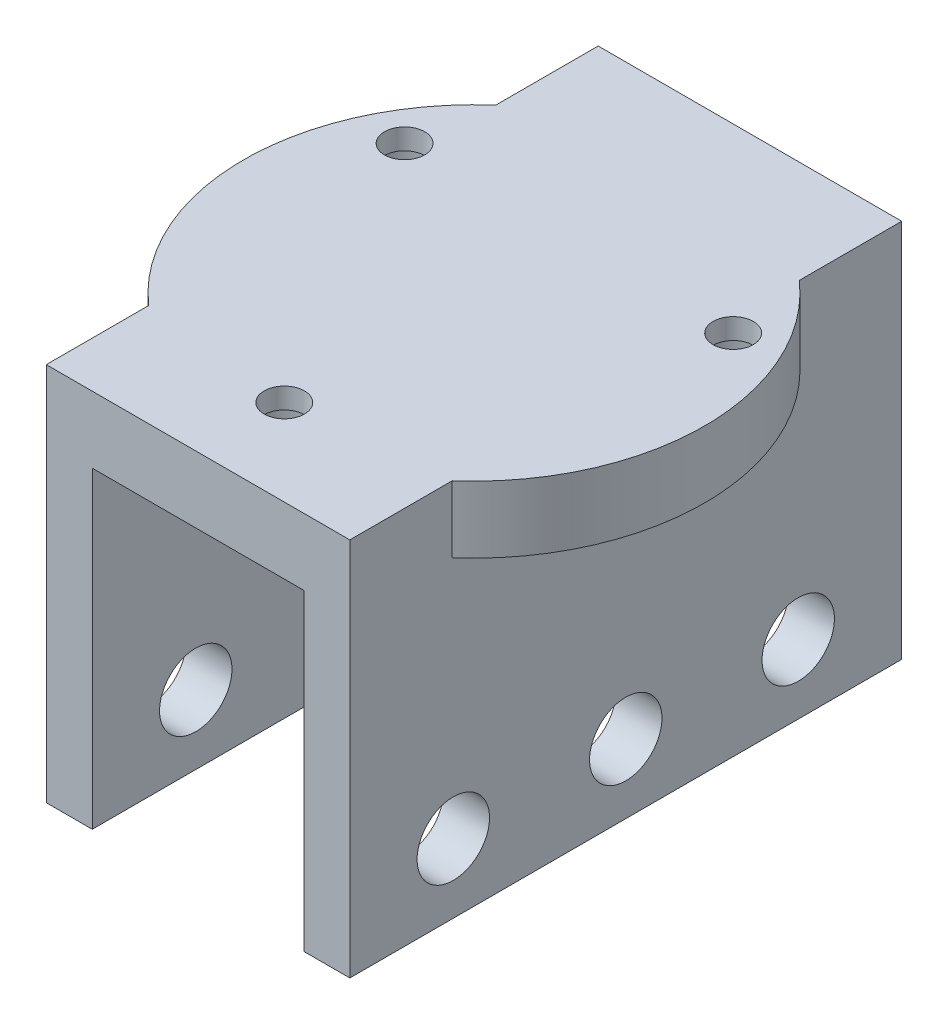
ISO-10303-21;
HEADER;
FILE_DESCRIPTION(('STEP AP214'),'2;1');
FILE_NAME('part.step','',(''),(''),'','','');
FILE_SCHEMA(('AUTOMOTIVE_DESIGN { 1 0 10303 214 1 1 1 1 }'));
ENDSEC;
DATA;
#1=APPLICATION_CONTEXT('core data for automotive mechanical design processes');
#2=APPLICATION_PROTOCOL_DEFINITION('international standard','automotive_design',2000,#1);
#3=PRODUCT_CONTEXT('',#1,'mechanical');
#4=PRODUCT('Part','Part','',(#3));
#5=PRODUCT_RELATED_PRODUCT_CATEGORY('part','',(#4));
#6=PRODUCT_DEFINITION_FORMATION('','',#4);
#7=PRODUCT_DEFINITION_CONTEXT('part definition',#1,'design');
#8=PRODUCT_DEFINITION('design','',#6,#7);
#9=PRODUCT_DEFINITION_SHAPE('','',#8);
#10=(LENGTH_UNIT() NAMED_UNIT(*) SI_UNIT(.MILLI.,.METRE.));
#11=(NAMED_UNIT(*) PLANE_ANGLE_UNIT() SI_UNIT($,.RADIAN.));
#12=(NAMED_UNIT(*) SI_UNIT($,.STERADIAN.) SOLID_ANGLE_UNIT());
#13=UNCERTAINTY_MEASURE_WITH_UNIT(LENGTH_MEASURE(1.E-05),#10,'distance_accuracy_value','');
#14=(GEOMETRIC_REPRESENTATION_CONTEXT(3) GLOBAL_UNCERTAINTY_ASSIGNED_CONTEXT((#13)) GLOBAL_UNIT_ASSIGNED_CONTEXT((#10,
#11,#12)) REPRESENTATION_CONTEXT('',''));
#15=CARTESIAN_POINT('',(0.,0.,0.));
#16=DIRECTION('',(0.,0.,1.));
#17=DIRECTION('',(1.,0.,0.));
#18=AXIS2_PLACEMENT_3D('',#15,#16,#17);
#19=CARTESIAN_POINT('',(26.4,33.,24.));
#20=DIRECTION('',(-1.,0.,0.));
#21=DIRECTION('',(0.,-1.,0.));
#22=AXIS2_PLACEMENT_3D('',#19,#20,#21);
#23=PLANE('',#22);
#24=CARTESIAN_POINT('',(26.4,6.,0.));
#25=DIRECTION('',(1.,0.,0.));
#26=DIRECTION('',(0.,1.,0.));
#27=AXIS2_PLACEMENT_3D('',#24,#25,#26);
#28=CIRCLE('',#27,3.15);
#29=CARTESIAN_POINT('',(26.4,9.15,0.));
#30=VERTEX_POINT('',#29);
#31=EDGE_CURVE('E182',#30,#30,#28,.T.);
#32=ORIENTED_EDGE('',*,*,#31,.F.);
#33=EDGE_LOOP('',(#32));
#34=FACE_BOUND('',#33,.T.);
#35=CARTESIAN_POINT('',(26.4,6.,-15.));
#36=DIRECTION('',(1.,0.,0.));
#37=DIRECTION('',(0.,1.,0.));
#38=AXIS2_PLACEMENT_3D('',#35,#36,#37);
#39=CIRCLE('',#38,3.15);
#40=CARTESIAN_POINT('',(26.4,9.15,-15.));
#41=VERTEX_POINT('',#40);
#42=EDGE_CURVE('E175',#41,#41,#39,.T.);
#43=ORIENTED_EDGE('',*,*,#42,.F.);
#44=EDGE_LOOP('',(#43));
#45=FACE_BOUND('',#44,.T.);
#46=CARTESIAN_POINT('',(26.4,6.,15.));
#47=DIRECTION('',(1.,0.,0.));
#48=DIRECTION('',(0.,1.,0.));
#49=AXIS2_PLACEMENT_3D('',#46,#47,#48);
#50=CIRCLE('',#49,3.15);
#51=CARTESIAN_POINT('',(26.4,9.15,15.));
#52=VERTEX_POINT('',#51);
#53=EDGE_CURVE('E174',#52,#52,#50,.T.);
#54=ORIENTED_EDGE('',*,*,#53,.F.);
#55=EDGE_LOOP('',(#54));
#56=FACE_BOUND('',#55,.T.);
#57=DIRECTION('',(0.,1.,0.));
#58=VECTOR('',#57,1.);
#59=CARTESIAN_POINT('',(26.4,21.2,-5.34773090694515));
#60=LINE('',#59,#58);
#61=CARTESIAN_POINT('',(26.4,27.2,-5.34773090694515));
#62=VERTEX_POINT('',#61);
#63=CARTESIAN_POINT('',(26.4,21.2,-5.34773090694515));
#64=VERTEX_POINT('',#63);
#65=EDGE_CURVE('E145',#62,#64,#60,.F.);
#66=ORIENTED_EDGE('',*,*,#65,.F.);
#67=DIRECTION('',(0.,0.,-1.));
#68=VECTOR('',#67,1.);
#69=CARTESIAN_POINT('',(26.4,27.2,24.));
#70=LINE('',#69,#68);
#71=CARTESIAN_POINT('',(26.4,27.2,15.0918024105804));
#72=VERTEX_POINT('',#71);
#73=EDGE_CURVE('E50',#72,#62,#70,.T.);
#74=ORIENTED_EDGE('',*,*,#73,.F.);
#75=DIRECTION('',(0.,1.,0.));
#76=VECTOR('',#75,1.);
#77=CARTESIAN_POINT('',(26.4,-29.5099638511611,15.0918024105804));
#78=LINE('',#77,#76);
#79=CARTESIAN_POINT('',(26.4,33.,15.0918024105804));
#80=VERTEX_POINT('',#79);
#81=EDGE_CURVE('E167',#72,#80,#78,.T.);
#82=ORIENTED_EDGE('',*,*,#81,.T.);
#83=DIRECTION('',(0.,0.,-1.));
#84=VECTOR('',#83,1.);
#85=CARTESIAN_POINT('',(26.4,33.,24.));
#86=LINE('',#85,#84);
#87=CARTESIAN_POINT('',(26.4,33.,24.));
#88=VERTEX_POINT('',#87);
#89=EDGE_CURVE('E253',#88,#80,#86,.T.);
#90=ORIENTED_EDGE('',*,*,#89,.F.);
#91=DIRECTION('',(0.,1.,0.));
#92=VECTOR('',#91,1.);
#93=CARTESIAN_POINT('',(26.4,33.,24.));
#94=LINE('',#93,#92);
#95=CARTESIAN_POINT('',(26.4,0.,24.));
#96=VERTEX_POINT('',#95);
#97=EDGE_CURVE('E223',#96,#88,#94,.T.);
#98=ORIENTED_EDGE('',*,*,#97,.F.);
#99=DIRECTION('',(0.,0.,-1.));
#100=VECTOR('',#99,1.);
#101=CARTESIAN_POINT('',(26.4,0.,24.));
#102=LINE('',#101,#100);
#103=CARTESIAN_POINT('',(26.4,0.,-24.));
#104=VERTEX_POINT('',#103);
#105=EDGE_CURVE('E256',#96,#104,#102,.T.);
#106=ORIENTED_EDGE('',*,*,#105,.T.);
#107=DIRECTION('',(0.,1.,0.));
#108=VECTOR('',#107,1.);
#109=CARTESIAN_POINT('',(26.4,33.,-24.));
#110=LINE('',#109,#108);
#111=CARTESIAN_POINT('',(26.4,33.,-24.));
#112=VERTEX_POINT('',#111);
#113=EDGE_CURVE('E242',#104,#112,#110,.T.);
#114=ORIENTED_EDGE('',*,*,#113,.T.);
#115=CARTESIAN_POINT('',(26.4,33.,-15.0918024105804));
#116=VERTEX_POINT('',#115);
#117=EDGE_CURVE('E57',#116,#112,#86,.T.);
#118=ORIENTED_EDGE('',*,*,#117,.F.);
#119=DIRECTION('',(0.,1.,0.));
#120=VECTOR('',#119,1.);
#121=CARTESIAN_POINT('',(26.4,-29.5099638511611,-15.0918024105804));
#122=LINE('',#121,#120);
#123=CARTESIAN_POINT('',(26.4,27.2,-15.0918024105804));
#124=VERTEX_POINT('',#123);
#125=EDGE_CURVE('E164',#116,#124,#122,.F.);
#126=ORIENTED_EDGE('',*,*,#125,.T.);
#127=CARTESIAN_POINT('',(26.4,27.2,-11.1522690930549));
#128=VERTEX_POINT('',#127);
#129=EDGE_CURVE('E165',#128,#124,#70,.T.);
#130=ORIENTED_EDGE('',*,*,#129,.F.);
#131=DIRECTION('',(0.,1.,0.));
#132=VECTOR('',#131,1.);
#133=CARTESIAN_POINT('',(26.4,21.2,-11.1522690930549));
#134=LINE('',#133,#132);
#135=CARTESIAN_POINT('',(26.4,21.2,-11.1522690930549));
#136=VERTEX_POINT('',#135);
#137=EDGE_CURVE('E152',#136,#128,#134,.T.);
#138=ORIENTED_EDGE('',*,*,#137,.F.);
#139=DIRECTION('',(0.,0.,1.));
#140=VECTOR('',#139,1.);
#141=CARTESIAN_POINT('',(26.4,21.2,24.));
#142=LINE('',#141,#140);
#143=EDGE_CURVE('E11',#136,#64,#142,.T.);
#144=ORIENTED_EDGE('',*,*,#143,.T.);
#145=EDGE_LOOP('',(#66,#74,#82,#90,#98,#106,#114,#118,#126,#130,#138,#144));
#146=FACE_BOUND('',#145,.T.);
#147=ADVANCED_FACE('F35',(#34,#45,#56,#146),#23,.F.);
#148=CARTESIAN_POINT('',(0.,0.,24.));
#149=DIRECTION('',(1.,0.,0.));
#150=DIRECTION('',(0.,0.,-1.));
#151=AXIS2_PLACEMENT_3D('',#148,#149,#150);
#152=PLANE('',#151);
#153=CARTESIAN_POINT('',(0.,6.,0.));
#154=DIRECTION('',(1.,0.,0.));
#155=DIRECTION('',(0.,0.,-1.));
#156=AXIS2_PLACEMENT_3D('',#153,#154,#155);
#157=CIRCLE('',#156,3.15);
#158=CARTESIAN_POINT('',(0.,6.,-3.15));
#159=VERTEX_POINT('',#158);
#160=EDGE_CURVE('E189',#159,#159,#157,.F.);
#161=ORIENTED_EDGE('',*,*,#160,.F.);
#162=EDGE_LOOP('',(#161));
#163=FACE_BOUND('',#162,.T.);
#164=CARTESIAN_POINT('',(0.,6.,-15.));
#165=DIRECTION('',(1.,0.,0.));
#166=DIRECTION('',(0.,0.,-1.));
#167=AXIS2_PLACEMENT_3D('',#164,#165,#166);
#168=CIRCLE('',#167,3.15);
#169=CARTESIAN_POINT('',(0.,6.,-18.15));
#170=VERTEX_POINT('',#169);
#171=EDGE_CURVE('E178',#170,#170,#168,.F.);
#172=ORIENTED_EDGE('',*,*,#171,.F.);
#173=EDGE_LOOP('',(#172));
#174=FACE_BOUND('',#173,.T.);
#175=CARTESIAN_POINT('',(0.,6.,15.));
#176=DIRECTION('',(1.,0.,0.));
#177=DIRECTION('',(0.,0.,-1.));
#178=AXIS2_PLACEMENT_3D('',#175,#176,#177);
#179=CIRCLE('',#178,3.15);
#180=CARTESIAN_POINT('',(0.,6.,11.85));
#181=VERTEX_POINT('',#180);
#182=EDGE_CURVE('E179',#181,#181,#179,.F.);
#183=ORIENTED_EDGE('',*,*,#182,.F.);
#184=EDGE_LOOP('',(#183));
#185=FACE_BOUND('',#184,.T.);
#186=DIRECTION('',(0.,1.,0.));
#187=VECTOR('',#186,1.);
#188=CARTESIAN_POINT('',(0.,21.2,-11.1522690930548));
#189=LINE('',#188,#187);
#190=CARTESIAN_POINT('',(0.,27.2,-11.1522690930548));
#191=VERTEX_POINT('',#190);
#192=CARTESIAN_POINT('',(0.,21.2,-11.1522690930548));
#193=VERTEX_POINT('',#192);
#194=EDGE_CURVE('E292',#191,#193,#189,.F.);
#195=ORIENTED_EDGE('',*,*,#194,.F.);
#196=DIRECTION('',(0.,0.,1.));
#197=VECTOR('',#196,1.);
#198=CARTESIAN_POINT('',(0.,27.2,24.));
#199=LINE('',#198,#197);
#200=CARTESIAN_POINT('',(0.,27.2,-15.0918024105804));
#201=VERTEX_POINT('',#200);
#202=EDGE_CURVE('E270',#201,#191,#199,.T.);
#203=ORIENTED_EDGE('',*,*,#202,.F.);
#204=DIRECTION('',(0.,1.,0.));
#205=VECTOR('',#204,1.);
#206=CARTESIAN_POINT('',(0.,-29.5099638511611,-15.0918024105804));
#207=LINE('',#206,#205);
#208=CARTESIAN_POINT('',(0.,33.,-15.0918024105804));
#209=VERTEX_POINT('',#208);
#210=EDGE_CURVE('E276',#201,#209,#207,.T.);
#211=ORIENTED_EDGE('',*,*,#210,.T.);
#212=DIRECTION('',(0.,0.,-1.));
#213=VECTOR('',#212,1.);
#214=CARTESIAN_POINT('',(0.,33.,24.));
#215=LINE('',#214,#213);
#216=CARTESIAN_POINT('',(0.,33.,-24.));
#217=VERTEX_POINT('',#216);
#218=EDGE_CURVE('E250',#209,#217,#215,.T.);
#219=ORIENTED_EDGE('',*,*,#218,.T.);
#220=DIRECTION('',(0.,-1.,0.));
#221=VECTOR('',#220,1.);
#222=CARTESIAN_POINT('',(0.,0.,-24.));
#223=LINE('',#222,#221);
#224=CARTESIAN_POINT('',(0.,0.,-24.));
#225=VERTEX_POINT('',#224);
#226=EDGE_CURVE('E215',#217,#225,#223,.T.);
#227=ORIENTED_EDGE('',*,*,#226,.T.);
#228=DIRECTION('',(0.,0.,-1.));
#229=VECTOR('',#228,1.);
#230=CARTESIAN_POINT('',(0.,0.,24.));
#231=LINE('',#230,#229);
#232=CARTESIAN_POINT('',(0.,0.,24.));
#233=VERTEX_POINT('',#232);
#234=EDGE_CURVE('E229',#233,#225,#231,.T.);
#235=ORIENTED_EDGE('',*,*,#234,.F.);
#236=DIRECTION('',(0.,-1.,0.));
#237=VECTOR('',#236,1.);
#238=CARTESIAN_POINT('',(0.,0.,24.));
#239=LINE('',#238,#237);
#240=CARTESIAN_POINT('',(0.,33.,24.));
#241=VERTEX_POINT('',#240);
#242=EDGE_CURVE('E227',#241,#233,#239,.T.);
#243=ORIENTED_EDGE('',*,*,#242,.F.);
#244=CARTESIAN_POINT('',(0.,33.,15.0918024105804));
#245=VERTEX_POINT('',#244);
#246=EDGE_CURVE('E251',#241,#245,#215,.T.);
#247=ORIENTED_EDGE('',*,*,#246,.T.);
#248=DIRECTION('',(0.,1.,0.));
#249=VECTOR('',#248,1.);
#250=CARTESIAN_POINT('',(0.,-29.5099638511611,15.0918024105804));
#251=LINE('',#250,#249);
#252=CARTESIAN_POINT('',(0.,27.2,15.0918024105804));
#253=VERTEX_POINT('',#252);
#254=EDGE_CURVE('E273',#245,#253,#251,.F.);
#255=ORIENTED_EDGE('',*,*,#254,.T.);
#256=CARTESIAN_POINT('',(0.,27.2,-5.34773090694513));
#257=VERTEX_POINT('',#256);
#258=EDGE_CURVE('E269',#257,#253,#199,.T.);
#259=ORIENTED_EDGE('',*,*,#258,.F.);
#260=DIRECTION('',(0.,1.,0.));
#261=VECTOR('',#260,1.);
#262=CARTESIAN_POINT('',(0.,21.2,-5.34773090694513));
#263=LINE('',#262,#261);
#264=CARTESIAN_POINT('',(0.,21.2,-5.34773090694513));
#265=VERTEX_POINT('',#264);
#266=EDGE_CURVE('E295',#265,#257,#263,.T.);
#267=ORIENTED_EDGE('',*,*,#266,.F.);
#268=DIRECTION('',(0.,0.,-1.));
#269=VECTOR('',#268,1.);
#270=CARTESIAN_POINT('',(0.,21.2,24.));
#271=LINE('',#270,#269);
#272=EDGE_CURVE('E43',#265,#193,#271,.T.);
#273=ORIENTED_EDGE('',*,*,#272,.T.);
#274=EDGE_LOOP('',(#195,#203,#211,#219,#227,#235,#243,#247,#255,#259,#267,#273));
#275=FACE_BOUND('',#274,.T.);
#276=ADVANCED_FACE('F291',(#163,#174,#185,#275),#152,.F.);
#277=CARTESIAN_POINT('',(27.4894191624432,22.2502525316942,-8.25000000000001));
#278=DIRECTION('',(0.,1.,0.));
#279=DIRECTION('',(0.,0.,1.));
#280=AXIS2_PLACEMENT_3D('',#277,#278,#279);
#281=CYLINDRICAL_SURFACE('',#280,1.75);
#282=CARTESIAN_POINT('',(27.4894191624432,33.,-8.25000000000001));
#283=DIRECTION('',(0.,1.,0.));
#284=DIRECTION('',(0.,0.,1.));
#285=AXIS2_PLACEMENT_3D('',#282,#283,#284);
#286=CIRCLE('',#285,1.75);
#287=CARTESIAN_POINT('',(27.4894191624432,33.,-6.50000000000001));
#288=VERTEX_POINT('',#287);
#289=EDGE_CURVE('E287',#288,#288,#286,.T.);
#290=ORIENTED_EDGE('',*,*,#289,.T.);
#291=EDGE_LOOP('',(#290));
#292=FACE_BOUND('',#291,.T.);
#293=CARTESIAN_POINT('',(27.4894191624432,31.2,-8.25000000000001));
#294=DIRECTION('',(0.,-1.,0.));
#295=DIRECTION('',(1.,0.,0.));
#296=AXIS2_PLACEMENT_3D('',#293,#294,#295);
#297=CIRCLE('',#296,1.75);
#298=CARTESIAN_POINT('',(29.2394191624432,31.2,-8.25000000000001));
#299=VERTEX_POINT('',#298);
#300=EDGE_CURVE('E285',#299,#299,#297,.F.);
#301=ORIENTED_EDGE('',*,*,#300,.F.);
#302=EDGE_LOOP('',(#301));
#303=FACE_BOUND('',#302,.T.);
#304=ADVANCED_FACE('F373',(#292,#303),#281,.F.);
#305=CARTESIAN_POINT('',(-1.08941916244325,22.2502525316942,-8.24999999999999));
#306=DIRECTION('',(0.,1.,0.));
#307=DIRECTION('',(0.,0.,1.));
#308=AXIS2_PLACEMENT_3D('',#305,#306,#307);
#309=CYLINDRICAL_SURFACE('',#308,1.75);
#310=CARTESIAN_POINT('',(-1.08941916244325,33.,-8.24999999999999));
#311=DIRECTION('',(0.,1.,0.));
#312=DIRECTION('',(0.,0.,1.));
#313=AXIS2_PLACEMENT_3D('',#310,#311,#312);
#314=CIRCLE('',#313,1.75);
#315=CARTESIAN_POINT('',(-1.08941916244325,33.,-6.49999999999999));
#316=VERTEX_POINT('',#315);
#317=EDGE_CURVE('E327',#316,#316,#314,.T.);
#318=ORIENTED_EDGE('',*,*,#317,.T.);
#319=EDGE_LOOP('',(#318));
#320=FACE_BOUND('',#319,.T.);
#321=CARTESIAN_POINT('',(-1.08941916244325,31.2,-8.24999999999999));
#322=DIRECTION('',(0.,-1.,0.));
#323=DIRECTION('',(1.,0.,0.));
#324=AXIS2_PLACEMENT_3D('',#321,#322,#323);
#325=CIRCLE('',#324,1.75);
#326=CARTESIAN_POINT('',(0.660580837556749,31.2,-8.24999999999999));
#327=VERTEX_POINT('',#326);
#328=EDGE_CURVE('E281',#327,#327,#325,.F.);
#329=ORIENTED_EDGE('',*,*,#328,.F.);
#330=EDGE_LOOP('',(#329));
#331=FACE_BOUND('',#330,.T.);
#332=ADVANCED_FACE('F436',(#320,#331),#309,.F.);
#333=CARTESIAN_POINT('',(13.2,22.2502525316942,16.5));
#334=DIRECTION('',(0.,1.,0.));
#335=DIRECTION('',(0.,0.,1.));
#336=AXIS2_PLACEMENT_3D('',#333,#334,#335);
#337=CYLINDRICAL_SURFACE('',#336,1.75);
#338=CARTESIAN_POINT('',(13.2,33.,16.5));
#339=DIRECTION('',(0.,1.,0.));
#340=DIRECTION('',(0.,0.,1.));
#341=AXIS2_PLACEMENT_3D('',#338,#339,#340);
#342=CIRCLE('',#341,1.75);
#343=CARTESIAN_POINT('',(13.2,33.,18.25));
#344=VERTEX_POINT('',#343);
#345=EDGE_CURVE('E323',#344,#344,#342,.T.);
#346=ORIENTED_EDGE('',*,*,#345,.T.);
#347=EDGE_LOOP('',(#346));
#348=FACE_BOUND('',#347,.T.);
#349=CARTESIAN_POINT('',(13.2,31.2,16.5));
#350=DIRECTION('',(0.,-1.,0.));
#351=DIRECTION('',(1.,0.,0.));
#352=AXIS2_PLACEMENT_3D('',#349,#350,#351);
#353=CIRCLE('',#352,1.75);
#354=CARTESIAN_POINT('',(14.95,31.2,16.5));
#355=VERTEX_POINT('',#354);
#356=EDGE_CURVE('E278',#355,#355,#353,.F.);
#357=ORIENTED_EDGE('',*,*,#356,.F.);
#358=EDGE_LOOP('',(#357));
#359=FACE_BOUND('',#358,.T.);
#360=ADVANCED_FACE('F397',(#348,#359),#337,.F.);
#361=CARTESIAN_POINT('',(4.,0.,24.));
#362=DIRECTION('',(0.,1.,0.));
#363=DIRECTION('',(-1.,0.,0.));
#364=AXIS2_PLACEMENT_3D('',#361,#362,#363);
#365=PLANE('',#364);
#366=DIRECTION('',(1.,0.,0.));
#367=VECTOR('',#366,1.);
#368=CARTESIAN_POINT('',(4.,0.,-24.));
#369=LINE('',#368,#367);
#370=CARTESIAN_POINT('',(4.,0.,-24.));
#371=VERTEX_POINT('',#370);
#372=EDGE_CURVE('E210',#225,#371,#369,.T.);
#373=ORIENTED_EDGE('',*,*,#372,.T.);
#374=DIRECTION('',(0.,0.,-1.));
#375=VECTOR('',#374,1.);
#376=CARTESIAN_POINT('',(4.,0.,24.));
#377=LINE('',#376,#375);
#378=CARTESIAN_POINT('',(4.,0.,24.));
#379=VERTEX_POINT('',#378);
#380=EDGE_CURVE('E266',#379,#371,#377,.T.);
#381=ORIENTED_EDGE('',*,*,#380,.F.);
#382=DIRECTION('',(1.,0.,0.));
#383=VECTOR('',#382,1.);
#384=CARTESIAN_POINT('',(4.,0.,24.));
#385=LINE('',#384,#383);
#386=EDGE_CURVE('E211',#233,#379,#385,.T.);
#387=ORIENTED_EDGE('',*,*,#386,.F.);
#388=ORIENTED_EDGE('',*,*,#234,.T.);
#389=EDGE_LOOP('',(#373,#381,#387,#388));
#390=FACE_BOUND('',#389,.T.);
#391=ADVANCED_FACE('F37',(#390),#365,.F.);
#392=CARTESIAN_POINT('',(4.,27.2,24.));
#393=DIRECTION('',(-1.,0.,0.));
#394=DIRECTION('',(0.,-1.,0.));
#395=AXIS2_PLACEMENT_3D('',#392,#393,#394);
#396=PLANE('',#395);
#397=CARTESIAN_POINT('',(4.,6.,15.));
#398=DIRECTION('',(-1.,0.,0.));
#399=DIRECTION('',(0.,-1.,0.));
#400=AXIS2_PLACEMENT_3D('',#397,#398,#399);
#401=CIRCLE('',#400,3.15);
#402=CARTESIAN_POINT('',(4.,2.85,15.));
#403=VERTEX_POINT('',#402);
#404=EDGE_CURVE('E207',#403,#403,#401,.T.);
#405=ORIENTED_EDGE('',*,*,#404,.T.);
#406=EDGE_LOOP('',(#405));
#407=FACE_BOUND('',#406,.T.);
#408=CARTESIAN_POINT('',(4.,6.,-15.));
#409=DIRECTION('',(-1.,0.,0.));
#410=DIRECTION('',(0.,-1.,0.));
#411=AXIS2_PLACEMENT_3D('',#408,#409,#410);
#412=CIRCLE('',#411,3.15);
#413=CARTESIAN_POINT('',(4.,2.85,-15.));
#414=VERTEX_POINT('',#413);
#415=EDGE_CURVE('E201',#414,#414,#412,.T.);
#416=ORIENTED_EDGE('',*,*,#415,.T.);
#417=EDGE_LOOP('',(#416));
#418=FACE_BOUND('',#417,.T.);
#419=CARTESIAN_POINT('',(4.,6.,0.));
#420=DIRECTION('',(-1.,0.,0.));
#421=DIRECTION('',(0.,-1.,0.));
#422=AXIS2_PLACEMENT_3D('',#419,#420,#421);
#423=CIRCLE('',#422,3.15);
#424=CARTESIAN_POINT('',(4.,2.85,0.));
#425=VERTEX_POINT('',#424);
#426=EDGE_CURVE('E195',#425,#425,#423,.T.);
#427=ORIENTED_EDGE('',*,*,#426,.T.);
#428=EDGE_LOOP('',(#427));
#429=FACE_BOUND('',#428,.T.);
#430=DIRECTION('',(0.,1.,0.));
#431=VECTOR('',#430,1.);
#432=CARTESIAN_POINT('',(4.,27.2,-24.));
#433=LINE('',#432,#431);
#434=CARTESIAN_POINT('',(4.,27.2,-24.));
#435=VERTEX_POINT('',#434);
#436=EDGE_CURVE('E232',#371,#435,#433,.T.);
#437=ORIENTED_EDGE('',*,*,#436,.T.);
#438=DIRECTION('',(0.,0.,-1.));
#439=VECTOR('',#438,1.);
#440=CARTESIAN_POINT('',(4.,27.2,24.));
#441=LINE('',#440,#439);
#442=CARTESIAN_POINT('',(4.,27.2,24.));
#443=VERTEX_POINT('',#442);
#444=EDGE_CURVE('E264',#443,#435,#441,.T.);
#445=ORIENTED_EDGE('',*,*,#444,.F.);
#446=DIRECTION('',(0.,1.,0.));
#447=VECTOR('',#446,1.);
#448=CARTESIAN_POINT('',(4.,27.2,24.));
#449=LINE('',#448,#447);
#450=EDGE_CURVE('E214',#379,#443,#449,.T.);
#451=ORIENTED_EDGE('',*,*,#450,.F.);
#452=ORIENTED_EDGE('',*,*,#380,.T.);
#453=EDGE_LOOP('',(#437,#445,#451,#452));
#454=FACE_BOUND('',#453,.T.);
#455=ADVANCED_FACE('F390',(#407,#418,#429,#454),#396,.F.);
#456=CARTESIAN_POINT('',(22.4,27.2,24.));
#457=DIRECTION('',(0.,1.,0.));
#458=DIRECTION('',(-1.,0.,0.));
#459=AXIS2_PLACEMENT_3D('',#456,#457,#458);
#460=PLANE('',#459);
#461=CARTESIAN_POINT('',(13.2,27.2,16.5));
#462=DIRECTION('',(0.,-1.,0.));
#463=DIRECTION('',(1.,0.,0.));
#464=AXIS2_PLACEMENT_3D('',#461,#462,#463);
#465=CIRCLE('',#464,3.1);
#466=CARTESIAN_POINT('',(16.3,27.2,16.5));
#467=VERTEX_POINT('',#466);
#468=EDGE_CURVE('E318',#467,#467,#465,.T.);
#469=ORIENTED_EDGE('',*,*,#468,.F.);
#470=EDGE_LOOP('',(#469));
#471=FACE_BOUND('',#470,.T.);
#472=DIRECTION('',(1.,0.,0.));
#473=VECTOR('',#472,1.);
#474=CARTESIAN_POINT('',(22.4,27.2,-24.));
#475=LINE('',#474,#473);
#476=CARTESIAN_POINT('',(22.4,27.2,-24.));
#477=VERTEX_POINT('',#476);
#478=EDGE_CURVE('E235',#435,#477,#475,.T.);
#479=ORIENTED_EDGE('',*,*,#478,.T.);
#480=DIRECTION('',(0.,0.,-1.));
#481=VECTOR('',#480,1.);
#482=CARTESIAN_POINT('',(22.4,27.2,24.));
#483=LINE('',#482,#481);
#484=CARTESIAN_POINT('',(22.4,27.2,24.));
#485=VERTEX_POINT('',#484);
#486=EDGE_CURVE('E262',#485,#477,#483,.T.);
#487=ORIENTED_EDGE('',*,*,#486,.F.);
#488=DIRECTION('',(1.,0.,0.));
#489=VECTOR('',#488,1.);
#490=CARTESIAN_POINT('',(22.4,27.2,24.));
#491=LINE('',#490,#489);
#492=EDGE_CURVE('E217',#443,#485,#491,.T.);
#493=ORIENTED_EDGE('',*,*,#492,.F.);
#494=ORIENTED_EDGE('',*,*,#444,.T.);
#495=EDGE_LOOP('',(#479,#487,#493,#494));
#496=FACE_BOUND('',#495,.T.);
#497=ADVANCED_FACE('F387',(#471,#496),#460,.F.);
#498=CARTESIAN_POINT('',(22.4,0.,24.));
#499=DIRECTION('',(1.,0.,0.));
#500=DIRECTION('',(0.,1.,0.));
#501=AXIS2_PLACEMENT_3D('',#498,#499,#500);
#502=PLANE('',#501);
#503=CARTESIAN_POINT('',(22.4,6.,15.));
#504=DIRECTION('',(1.,0.,0.));
#505=DIRECTION('',(0.,1.,0.));
#506=AXIS2_PLACEMENT_3D('',#503,#504,#505);
#507=CIRCLE('',#506,3.15);
#508=CARTESIAN_POINT('',(22.4,9.15,15.));
#509=VERTEX_POINT('',#508);
#510=EDGE_CURVE('E204',#509,#509,#507,.T.);
#511=ORIENTED_EDGE('',*,*,#510,.T.);
#512=EDGE_LOOP('',(#511));
#513=FACE_BOUND('',#512,.T.);
#514=CARTESIAN_POINT('',(22.4,6.,-15.));
#515=DIRECTION('',(1.,0.,0.));
#516=DIRECTION('',(0.,1.,0.));
#517=AXIS2_PLACEMENT_3D('',#514,#515,#516);
#518=CIRCLE('',#517,3.15);
#519=CARTESIAN_POINT('',(22.4,9.15,-15.));
#520=VERTEX_POINT('',#519);
#521=EDGE_CURVE('E198',#520,#520,#518,.T.);
#522=ORIENTED_EDGE('',*,*,#521,.T.);
#523=EDGE_LOOP('',(#522));
#524=FACE_BOUND('',#523,.T.);
#525=CARTESIAN_POINT('',(22.4,6.,0.));
#526=DIRECTION('',(1.,0.,0.));
#527=DIRECTION('',(0.,1.,0.));
#528=AXIS2_PLACEMENT_3D('',#525,#526,#527);
#529=CIRCLE('',#528,3.15);
#530=CARTESIAN_POINT('',(22.4,9.15,0.));
#531=VERTEX_POINT('',#530);
#532=EDGE_CURVE('E192',#531,#531,#529,.T.);
#533=ORIENTED_EDGE('',*,*,#532,.T.);
#534=EDGE_LOOP('',(#533));
#535=FACE_BOUND('',#534,.T.);
#536=DIRECTION('',(0.,-1.,0.));
#537=VECTOR('',#536,1.);
#538=CARTESIAN_POINT('',(22.4,0.,-24.));
#539=LINE('',#538,#537);
#540=CARTESIAN_POINT('',(22.4,0.,-24.));
#541=VERTEX_POINT('',#540);
#542=EDGE_CURVE('E238',#477,#541,#539,.T.);
#543=ORIENTED_EDGE('',*,*,#542,.T.);
#544=DIRECTION('',(0.,0.,-1.));
#545=VECTOR('',#544,1.);
#546=CARTESIAN_POINT('',(22.4,0.,24.));
#547=LINE('',#546,#545);
#548=CARTESIAN_POINT('',(22.4,0.,24.));
#549=VERTEX_POINT('',#548);
#550=EDGE_CURVE('E259',#549,#541,#547,.T.);
#551=ORIENTED_EDGE('',*,*,#550,.F.);
#552=DIRECTION('',(0.,-1.,0.));
#553=VECTOR('',#552,1.);
#554=CARTESIAN_POINT('',(22.4,0.,24.));
#555=LINE('',#554,#553);
#556=EDGE_CURVE('E219',#485,#549,#555,.T.);
#557=ORIENTED_EDGE('',*,*,#556,.F.);
#558=ORIENTED_EDGE('',*,*,#486,.T.);
#559=EDGE_LOOP('',(#543,#551,#557,#558));
#560=FACE_BOUND('',#559,.T.);
#561=ADVANCED_FACE('F383',(#513,#524,#535,#560),#502,.F.);
#562=CARTESIAN_POINT('',(26.4,0.,24.));
#563=DIRECTION('',(0.,1.,0.));
#564=DIRECTION('',(-1.,0.,0.));
#565=AXIS2_PLACEMENT_3D('',#562,#563,#564);
#566=PLANE('',#565);
#567=DIRECTION('',(1.,0.,0.));
#568=VECTOR('',#567,1.);
#569=CARTESIAN_POINT('',(26.4,0.,-24.));
#570=LINE('',#569,#568);
#571=EDGE_CURVE('E240',#541,#104,#570,.T.);
#572=ORIENTED_EDGE('',*,*,#571,.T.);
#573=ORIENTED_EDGE('',*,*,#105,.F.);
#574=DIRECTION('',(1.,0.,0.));
#575=VECTOR('',#574,1.);
#576=CARTESIAN_POINT('',(26.4,0.,24.));
#577=LINE('',#576,#575);
#578=EDGE_CURVE('E221',#549,#96,#577,.T.);
#579=ORIENTED_EDGE('',*,*,#578,.F.);
#580=ORIENTED_EDGE('',*,*,#550,.T.);
#581=EDGE_LOOP('',(#572,#573,#579,#580));
#582=FACE_BOUND('',#581,.T.);
#583=ADVANCED_FACE('F380',(#582),#566,.F.);
#584=CARTESIAN_POINT('',(0.,33.,24.));
#585=DIRECTION('',(0.,-1.,0.));
#586=DIRECTION('',(0.,0.,-1.));
#587=AXIS2_PLACEMENT_3D('',#584,#585,#586);
#588=PLANE('',#587);
#589=ORIENTED_EDGE('',*,*,#345,.F.);
#590=EDGE_LOOP('',(#589));
#591=FACE_BOUND('',#590,.T.);
#592=ORIENTED_EDGE('',*,*,#317,.F.);
#593=EDGE_LOOP('',(#592));
#594=FACE_BOUND('',#593,.T.);
#595=ORIENTED_EDGE('',*,*,#289,.F.);
#596=EDGE_LOOP('',(#595));
#597=FACE_BOUND('',#596,.T.);
#598=ORIENTED_EDGE('',*,*,#218,.F.);
#599=CARTESIAN_POINT('',(13.2,33.,0.));
#600=DIRECTION('',(0.,1.,0.));
#601=DIRECTION('',(0.,0.,1.));
#602=AXIS2_PLACEMENT_3D('',#599,#600,#601);
#603=CIRCLE('',#602,20.05);
#604=EDGE_CURVE('E326',#209,#245,#603,.T.);
#605=ORIENTED_EDGE('',*,*,#604,.T.);
#606=ORIENTED_EDGE('',*,*,#246,.F.);
#607=DIRECTION('',(-1.,0.,0.));
#608=VECTOR('',#607,1.);
#609=CARTESIAN_POINT('',(0.,33.,24.));
#610=LINE('',#609,#608);
#611=EDGE_CURVE('E225',#88,#241,#610,.T.);
#612=ORIENTED_EDGE('',*,*,#611,.F.);
#613=ORIENTED_EDGE('',*,*,#89,.T.);
#614=EDGE_CURVE('E331',#80,#116,#603,.T.);
#615=ORIENTED_EDGE('',*,*,#614,.T.);
#616=ORIENTED_EDGE('',*,*,#117,.T.);
#617=DIRECTION('',(-1.,0.,0.));
#618=VECTOR('',#617,1.);
#619=CARTESIAN_POINT('',(0.,33.,-24.));
#620=LINE('',#619,#618);
#621=EDGE_CURVE('E244',#112,#217,#620,.T.);
#622=ORIENTED_EDGE('',*,*,#621,.T.);
#623=EDGE_LOOP('',(#598,#605,#606,#612,#613,#615,#616,#622));
#624=FACE_BOUND('',#623,.T.);
#625=ADVANCED_FACE('F340',(#591,#594,#597,#624),#588,.F.);
#626=CARTESIAN_POINT('',(0.,0.,24.));
#627=DIRECTION('',(0.,0.,-1.));
#628=DIRECTION('',(-1.,0.,0.));
#629=AXIS2_PLACEMENT_3D('',#626,#627,#628);
#630=PLANE('',#629);
#631=ORIENTED_EDGE('',*,*,#386,.T.);
#632=ORIENTED_EDGE('',*,*,#450,.T.);
#633=ORIENTED_EDGE('',*,*,#492,.T.);
#634=ORIENTED_EDGE('',*,*,#556,.T.);
#635=ORIENTED_EDGE('',*,*,#578,.T.);
#636=ORIENTED_EDGE('',*,*,#97,.T.);
#637=ORIENTED_EDGE('',*,*,#611,.T.);
#638=ORIENTED_EDGE('',*,*,#242,.T.);
#639=EDGE_LOOP('',(#631,#632,#633,#634,#635,#636,#637,#638));
#640=FACE_BOUND('',#639,.T.);
#641=ADVANCED_FACE('F351',(#640),#630,.F.);
#642=CARTESIAN_POINT('',(0.,0.,-24.));
#643=DIRECTION('',(0.,0.,-1.));
#644=DIRECTION('',(-1.,0.,0.));
#645=AXIS2_PLACEMENT_3D('',#642,#643,#644);
#646=PLANE('',#645);
#647=ORIENTED_EDGE('',*,*,#372,.F.);
#648=ORIENTED_EDGE('',*,*,#226,.F.);
#649=ORIENTED_EDGE('',*,*,#621,.F.);
#650=ORIENTED_EDGE('',*,*,#113,.F.);
#651=ORIENTED_EDGE('',*,*,#571,.F.);
#652=ORIENTED_EDGE('',*,*,#542,.F.);
#653=ORIENTED_EDGE('',*,*,#478,.F.);
#654=ORIENTED_EDGE('',*,*,#436,.F.);
#655=EDGE_LOOP('',(#647,#648,#649,#650,#651,#652,#653,#654));
#656=FACE_BOUND('',#655,.T.);
#657=ADVANCED_FACE('F411',(#656),#646,.T.);
#658=CARTESIAN_POINT('',(-8.9095454429505,6.,0.));
#659=DIRECTION('',(1.,0.,0.));
#660=DIRECTION('',(0.,1.,0.));
#661=AXIS2_PLACEMENT_3D('',#658,#659,#660);
#662=CYLINDRICAL_SURFACE('',#661,3.15);
#663=ORIENTED_EDGE('',*,*,#160,.T.);
#664=EDGE_LOOP('',(#663));
#665=FACE_BOUND('',#664,.T.);
#666=ORIENTED_EDGE('',*,*,#426,.F.);
#667=EDGE_LOOP('',(#666));
#668=FACE_BOUND('',#667,.T.);
#669=ADVANCED_FACE('F595',(#665,#668),#662,.F.);
#670=CARTESIAN_POINT('',(-8.9095454429505,6.,-15.));
#671=DIRECTION('',(1.,0.,0.));
#672=DIRECTION('',(0.,1.,0.));
#673=AXIS2_PLACEMENT_3D('',#670,#671,#672);
#674=CYLINDRICAL_SURFACE('',#673,3.15);
#675=ORIENTED_EDGE('',*,*,#171,.T.);
#676=EDGE_LOOP('',(#675));
#677=FACE_BOUND('',#676,.T.);
#678=ORIENTED_EDGE('',*,*,#415,.F.);
#679=EDGE_LOOP('',(#678));
#680=FACE_BOUND('',#679,.T.);
#681=ADVANCED_FACE('F602',(#677,#680),#674,.F.);
#682=CARTESIAN_POINT('',(-8.9095454429505,6.,15.));
#683=DIRECTION('',(1.,0.,0.));
#684=DIRECTION('',(0.,1.,0.));
#685=AXIS2_PLACEMENT_3D('',#682,#683,#684);
#686=CYLINDRICAL_SURFACE('',#685,3.15);
#687=ORIENTED_EDGE('',*,*,#182,.T.);
#688=EDGE_LOOP('',(#687));
#689=FACE_BOUND('',#688,.T.);
#690=ORIENTED_EDGE('',*,*,#404,.F.);
#691=EDGE_LOOP('',(#690));
#692=FACE_BOUND('',#691,.T.);
#693=ADVANCED_FACE('F432',(#689,#692),#686,.F.);
#694=ORIENTED_EDGE('',*,*,#31,.T.);
#695=EDGE_LOOP('',(#694));
#696=FACE_BOUND('',#695,.T.);
#697=ORIENTED_EDGE('',*,*,#532,.F.);
#698=EDGE_LOOP('',(#697));
#699=FACE_BOUND('',#698,.T.);
#700=ADVANCED_FACE('F605',(#696,#699),#662,.F.);
#701=ORIENTED_EDGE('',*,*,#42,.T.);
#702=EDGE_LOOP('',(#701));
#703=FACE_BOUND('',#702,.T.);
#704=ORIENTED_EDGE('',*,*,#521,.F.);
#705=EDGE_LOOP('',(#704));
#706=FACE_BOUND('',#705,.T.);
#707=ADVANCED_FACE('F429',(#703,#706),#674,.F.);
#708=ORIENTED_EDGE('',*,*,#53,.T.);
#709=EDGE_LOOP('',(#708));
#710=FACE_BOUND('',#709,.T.);
#711=ORIENTED_EDGE('',*,*,#510,.F.);
#712=EDGE_LOOP('',(#711));
#713=FACE_BOUND('',#712,.T.);
#714=ADVANCED_FACE('F425',(#710,#713),#686,.F.);
#715=CARTESIAN_POINT('',(22.4,27.2,24.));
#716=DIRECTION('',(0.,1.,0.));
#717=DIRECTION('',(-1.,0.,0.));
#718=AXIS2_PLACEMENT_3D('',#715,#716,#717);
#719=PLANE('',#718);
#720=ORIENTED_EDGE('',*,*,#202,.T.);
#721=CARTESIAN_POINT('',(-1.08941916244325,27.2,-8.24999999999999));
#722=DIRECTION('',(0.,-1.,0.));
#723=DIRECTION('',(1.,0.,0.));
#724=AXIS2_PLACEMENT_3D('',#721,#722,#723);
#725=CIRCLE('',#724,3.1);
#726=EDGE_CURVE('E313',#257,#191,#725,.T.);
#727=ORIENTED_EDGE('',*,*,#726,.F.);
#728=ORIENTED_EDGE('',*,*,#258,.T.);
#729=CARTESIAN_POINT('',(13.2,27.2,0.));
#730=DIRECTION('',(0.,1.,0.));
#731=DIRECTION('',(-1.,0.,0.));
#732=AXIS2_PLACEMENT_3D('',#729,#730,#731);
#733=CIRCLE('',#732,20.05);
#734=EDGE_CURVE('E170',#253,#201,#733,.F.);
#735=ORIENTED_EDGE('',*,*,#734,.T.);
#736=EDGE_LOOP('',(#720,#727,#728,#735));
#737=FACE_BOUND('',#736,.T.);
#738=ADVANCED_FACE('F365',(#737),#719,.F.);
#739=CARTESIAN_POINT('',(13.2,-29.5099638511611,0.));
#740=DIRECTION('',(0.,1.,0.));
#741=DIRECTION('',(0.,0.,1.));
#742=AXIS2_PLACEMENT_3D('',#739,#740,#741);
#743=CYLINDRICAL_SURFACE('',#742,20.05);
#744=ORIENTED_EDGE('',*,*,#210,.F.);
#745=ORIENTED_EDGE('',*,*,#734,.F.);
#746=ORIENTED_EDGE('',*,*,#254,.F.);
#747=ORIENTED_EDGE('',*,*,#604,.F.);
#748=EDGE_LOOP('',(#744,#745,#746,#747));
#749=FACE_BOUND('',#748,.T.);
#750=ADVANCED_FACE('F346',(#749),#743,.T.);
#751=ORIENTED_EDGE('',*,*,#81,.F.);
#752=EDGE_CURVE('E163',#124,#72,#733,.F.);
#753=ORIENTED_EDGE('',*,*,#752,.F.);
#754=ORIENTED_EDGE('',*,*,#125,.F.);
#755=ORIENTED_EDGE('',*,*,#614,.F.);
#756=EDGE_LOOP('',(#751,#753,#754,#755));
#757=FACE_BOUND('',#756,.T.);
#758=ADVANCED_FACE('F356',(#757),#743,.T.);
#759=ORIENTED_EDGE('',*,*,#73,.T.);
#760=CARTESIAN_POINT('',(27.4894191624432,27.2,-8.25000000000001));
#761=DIRECTION('',(0.,-1.,0.));
#762=DIRECTION('',(1.,0.,0.));
#763=AXIS2_PLACEMENT_3D('',#760,#761,#762);
#764=CIRCLE('',#763,3.1);
#765=EDGE_CURVE('E151',#128,#62,#764,.T.);
#766=ORIENTED_EDGE('',*,*,#765,.F.);
#767=ORIENTED_EDGE('',*,*,#129,.T.);
#768=ORIENTED_EDGE('',*,*,#752,.T.);
#769=EDGE_LOOP('',(#759,#766,#767,#768));
#770=FACE_BOUND('',#769,.T.);
#771=ADVANCED_FACE('F161',(#770),#719,.F.);
#772=CARTESIAN_POINT('',(13.2,31.2,16.5));
#773=DIRECTION('',(0.,-1.,0.));
#774=DIRECTION('',(1.,0.,0.));
#775=AXIS2_PLACEMENT_3D('',#772,#773,#774);
#776=PLANE('',#775);
#777=CARTESIAN_POINT('',(13.2,31.2,16.5));
#778=DIRECTION('',(0.,-1.,0.));
#779=DIRECTION('',(1.,0.,0.));
#780=AXIS2_PLACEMENT_3D('',#777,#778,#779);
#781=CIRCLE('',#780,3.1);
#782=CARTESIAN_POINT('',(16.3,31.2,16.5));
#783=VERTEX_POINT('',#782);
#784=EDGE_CURVE('E315',#783,#783,#781,.T.);
#785=ORIENTED_EDGE('',*,*,#784,.T.);
#786=EDGE_LOOP('',(#785));
#787=FACE_BOUND('',#786,.T.);
#788=ORIENTED_EDGE('',*,*,#356,.T.);
#789=EDGE_LOOP('',(#788));
#790=FACE_BOUND('',#789,.T.);
#791=ADVANCED_FACE('F363',(#787,#790),#776,.T.);
#792=CARTESIAN_POINT('',(13.2,31.2,16.5));
#793=DIRECTION('',(0.,-1.,0.));
#794=DIRECTION('',(1.,0.,0.));
#795=AXIS2_PLACEMENT_3D('',#792,#793,#794);
#796=CYLINDRICAL_SURFACE('',#795,3.1);
#797=ORIENTED_EDGE('',*,*,#784,.F.);
#798=EDGE_LOOP('',(#797));
#799=FACE_BOUND('',#798,.T.);
#800=ORIENTED_EDGE('',*,*,#468,.T.);
#801=EDGE_LOOP('',(#800));
#802=FACE_BOUND('',#801,.T.);
#803=ADVANCED_FACE('F452',(#799,#802),#796,.F.);
#804=CARTESIAN_POINT('',(-1.08941916244325,31.2,-8.24999999999999));
#805=DIRECTION('',(0.,-1.,0.));
#806=DIRECTION('',(1.,0.,0.));
#807=AXIS2_PLACEMENT_3D('',#804,#805,#806);
#808=PLANE('',#807);
#809=CARTESIAN_POINT('',(-1.08941916244325,31.2,-8.24999999999999));
#810=DIRECTION('',(0.,-1.,0.));
#811=DIRECTION('',(1.,0.,0.));
#812=AXIS2_PLACEMENT_3D('',#809,#810,#811);
#813=CIRCLE('',#812,3.1);
#814=CARTESIAN_POINT('',(2.01058083755675,31.2,-8.24999999999999));
#815=VERTEX_POINT('',#814);
#816=EDGE_CURVE('E282',#815,#815,#813,.T.);
#817=ORIENTED_EDGE('',*,*,#816,.T.);
#818=EDGE_LOOP('',(#817));
#819=FACE_BOUND('',#818,.T.);
#820=ORIENTED_EDGE('',*,*,#328,.T.);
#821=EDGE_LOOP('',(#820));
#822=FACE_BOUND('',#821,.T.);
#823=ADVANCED_FACE('F455',(#819,#822),#808,.T.);
#824=CARTESIAN_POINT('',(-1.08941916244325,31.2,-8.24999999999999));
#825=DIRECTION('',(0.,-1.,0.));
#826=DIRECTION('',(1.,0.,0.));
#827=AXIS2_PLACEMENT_3D('',#824,#825,#826);
#828=CYLINDRICAL_SURFACE('',#827,3.1);
#829=ORIENTED_EDGE('',*,*,#816,.F.);
#830=EDGE_LOOP('',(#829));
#831=FACE_BOUND('',#830,.T.);
#832=ORIENTED_EDGE('',*,*,#726,.T.);
#833=ORIENTED_EDGE('',*,*,#194,.T.);
#834=CARTESIAN_POINT('',(-1.08941916244325,21.2,-8.24999999999999));
#835=DIRECTION('',(0.,-1.,0.));
#836=DIRECTION('',(1.,0.,0.));
#837=AXIS2_PLACEMENT_3D('',#834,#835,#836);
#838=CIRCLE('',#837,3.1);
#839=EDGE_CURVE('E300',#193,#265,#838,.T.);
#840=ORIENTED_EDGE('',*,*,#839,.T.);
#841=ORIENTED_EDGE('',*,*,#266,.T.);
#842=EDGE_LOOP('',(#832,#833,#840,#841));
#843=FACE_BOUND('',#842,.T.);
#844=ADVANCED_FACE('F302',(#831,#843),#828,.F.);
#845=CARTESIAN_POINT('',(27.4894191624432,31.2,-8.25000000000001));
#846=DIRECTION('',(0.,-1.,0.));
#847=DIRECTION('',(1.,0.,0.));
#848=AXIS2_PLACEMENT_3D('',#845,#846,#847);
#849=PLANE('',#848);
#850=CARTESIAN_POINT('',(27.4894191624432,31.2,-8.25000000000001));
#851=DIRECTION('',(0.,-1.,0.));
#852=DIRECTION('',(1.,0.,0.));
#853=AXIS2_PLACEMENT_3D('',#850,#851,#852);
#854=CIRCLE('',#853,3.1);
#855=CARTESIAN_POINT('',(30.5894191624432,31.2,-8.25000000000001));
#856=VERTEX_POINT('',#855);
#857=EDGE_CURVE('E158',#856,#856,#854,.T.);
#858=ORIENTED_EDGE('',*,*,#857,.T.);
#859=EDGE_LOOP('',(#858));
#860=FACE_BOUND('',#859,.T.);
#861=ORIENTED_EDGE('',*,*,#300,.T.);
#862=EDGE_LOOP('',(#861));
#863=FACE_BOUND('',#862,.T.);
#864=ADVANCED_FACE('F447',(#860,#863),#849,.T.);
#865=CARTESIAN_POINT('',(27.4894191624432,31.2,-8.25000000000001));
#866=DIRECTION('',(0.,-1.,0.));
#867=DIRECTION('',(1.,0.,0.));
#868=AXIS2_PLACEMENT_3D('',#865,#866,#867);
#869=CYLINDRICAL_SURFACE('',#868,3.1);
#870=ORIENTED_EDGE('',*,*,#857,.F.);
#871=EDGE_LOOP('',(#870));
#872=FACE_BOUND('',#871,.T.);
#873=ORIENTED_EDGE('',*,*,#765,.T.);
#874=ORIENTED_EDGE('',*,*,#65,.T.);
#875=CARTESIAN_POINT('',(27.4894191624432,21.2,-8.25000000000001));
#876=DIRECTION('',(0.,-1.,0.));
#877=DIRECTION('',(1.,0.,0.));
#878=AXIS2_PLACEMENT_3D('',#875,#876,#877);
#879=CIRCLE('',#878,3.1);
#880=EDGE_CURVE('E304',#64,#136,#879,.T.);
#881=ORIENTED_EDGE('',*,*,#880,.T.);
#882=ORIENTED_EDGE('',*,*,#137,.T.);
#883=EDGE_LOOP('',(#873,#874,#881,#882));
#884=FACE_BOUND('',#883,.T.);
#885=ADVANCED_FACE('F155',(#872,#884),#869,.F.);
#886=CARTESIAN_POINT('',(27.4894191624432,21.2,-8.25000000000001));
#887=DIRECTION('',(0.,-1.,0.));
#888=DIRECTION('',(1.,0.,0.));
#889=AXIS2_PLACEMENT_3D('',#886,#887,#888);
#890=PLANE('',#889);
#891=ORIENTED_EDGE('',*,*,#880,.F.);
#892=ORIENTED_EDGE('',*,*,#143,.F.);
#893=EDGE_LOOP('',(#891,#892));
#894=FACE_BOUND('',#893,.T.);
#895=ADVANCED_FACE('F446',(#894),#890,.F.);
#896=CARTESIAN_POINT('',(0.,21.2,0.));
#897=DIRECTION('',(0.,-1.,0.));
#898=DIRECTION('',(1.,0.,0.));
#899=AXIS2_PLACEMENT_3D('',#896,#897,#898);
#900=PLANE('',#899);
#901=ORIENTED_EDGE('',*,*,#839,.F.);
#902=ORIENTED_EDGE('',*,*,#272,.F.);
#903=EDGE_LOOP('',(#901,#902));
#904=FACE_BOUND('',#903,.T.);
#905=ADVANCED_FACE('F299',(#904),#900,.F.);
#906=CLOSED_SHELL('',(#147,#276,#304,#332,#360,#391,#455,#497,#561,#583,#625,#641,#657,#669,
#681,#693,#700,#707,#714,#738,#750,#758,#771,#791,#803,#823,#844,#864,#885,#895,#905));
#907=MANIFOLD_SOLID_BREP('B2',#906);
#908=ADVANCED_BREP_SHAPE_REPRESENTATION('',(#18,#907),#14);
#909=SHAPE_DEFINITION_REPRESENTATION(#9,#908);
ENDSEC;
END-ISO-10303-21;
